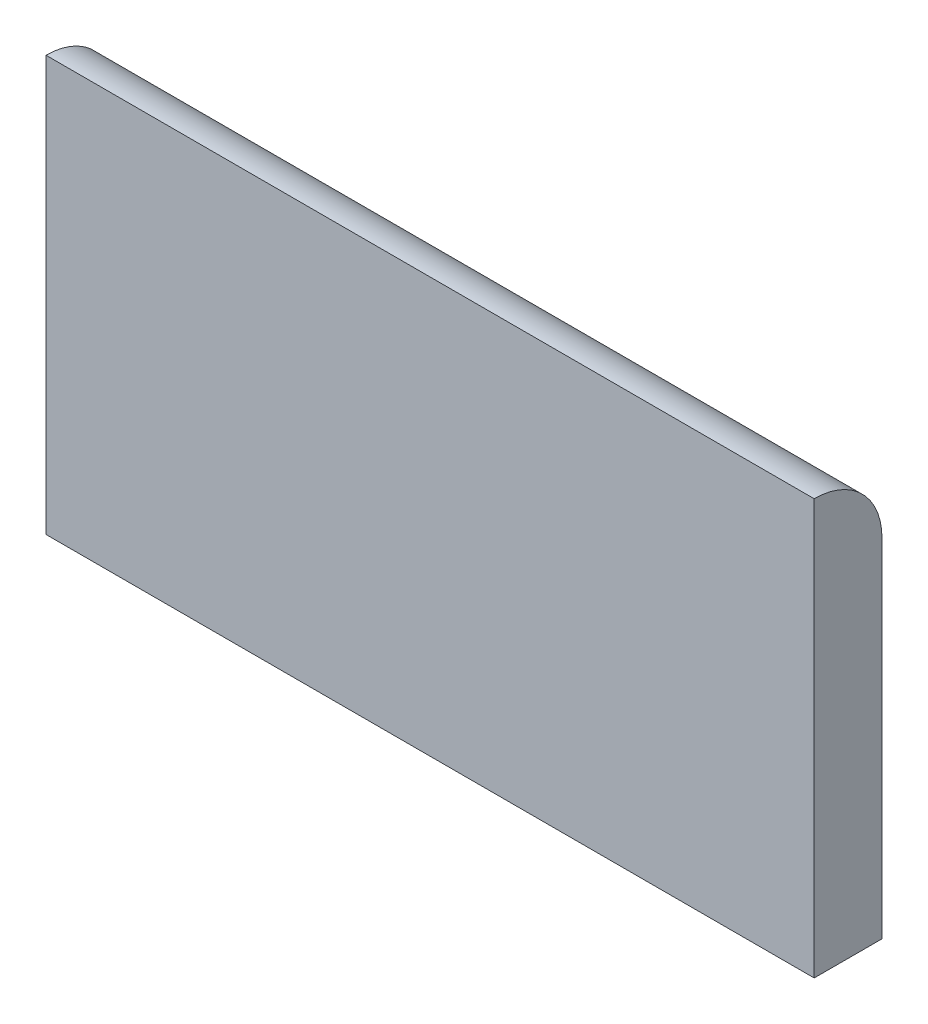
ISO-10303-21;
HEADER;
FILE_DESCRIPTION(('STEP AP214'),'2;1');
FILE_NAME('part.step','',(''),(''),'','','');
FILE_SCHEMA(('AUTOMOTIVE_DESIGN { 1 0 10303 214 1 1 1 1 }'));
ENDSEC;
DATA;
#1=APPLICATION_CONTEXT('core data for automotive mechanical design processes');
#2=APPLICATION_PROTOCOL_DEFINITION('international standard','automotive_design',2000,#1);
#3=PRODUCT_CONTEXT('',#1,'mechanical');
#4=PRODUCT('Part','Part','',(#3));
#5=PRODUCT_RELATED_PRODUCT_CATEGORY('part','',(#4));
#6=PRODUCT_DEFINITION_FORMATION('','',#4);
#7=PRODUCT_DEFINITION_CONTEXT('part definition',#1,'design');
#8=PRODUCT_DEFINITION('design','',#6,#7);
#9=PRODUCT_DEFINITION_SHAPE('','',#8);
#10=(LENGTH_UNIT() NAMED_UNIT(*) SI_UNIT(.MILLI.,.METRE.));
#11=(NAMED_UNIT(*) PLANE_ANGLE_UNIT() SI_UNIT($,.RADIAN.));
#12=(NAMED_UNIT(*) SI_UNIT($,.STERADIAN.) SOLID_ANGLE_UNIT());
#13=UNCERTAINTY_MEASURE_WITH_UNIT(LENGTH_MEASURE(1.E-05),#10,'distance_accuracy_value','');
#14=(GEOMETRIC_REPRESENTATION_CONTEXT(3) GLOBAL_UNCERTAINTY_ASSIGNED_CONTEXT((#13)) GLOBAL_UNIT_ASSIGNED_CONTEXT((#10,
#11,#12)) REPRESENTATION_CONTEXT('',''));
#15=CARTESIAN_POINT('',(0.,0.,0.));
#16=DIRECTION('',(0.,0.,1.));
#17=DIRECTION('',(1.,0.,0.));
#18=AXIS2_PLACEMENT_3D('',#15,#16,#17);
#19=CARTESIAN_POINT('',(-92.5935600232119,54.9638896223897,10.));
#20=DIRECTION('',(1.,0.,0.));
#21=DIRECTION('',(0.,0.,-1.));
#22=AXIS2_PLACEMENT_3D('',#19,#20,#21);
#23=PLANE('',#22);
#24=DIRECTION('',(0.,-1.,0.));
#25=VECTOR('',#24,1.);
#26=CARTESIAN_POINT('',(-92.5935600232119,54.9638896223897,10.));
#27=LINE('',#26,#25);
#28=CARTESIAN_POINT('',(-92.5935600232119,54.9638896223897,10.));
#29=VERTEX_POINT('',#28);
#30=CARTESIAN_POINT('',(-92.5935600232119,-6.25464191295969,10.));
#31=VERTEX_POINT('',#30);
#32=EDGE_CURVE('E96',#29,#31,#27,.T.);
#33=ORIENTED_EDGE('',*,*,#32,.F.);
#34=CARTESIAN_POINT('',(-92.5935600232119,44.9638896223897,10.));
#35=DIRECTION('',(1.,0.,0.));
#36=DIRECTION('',(0.,0.,-1.));
#37=AXIS2_PLACEMENT_3D('',#34,#35,#36);
#38=CIRCLE('',#37,10.);
#39=CARTESIAN_POINT('',(-92.5935600232119,44.9638896223897,0.));
#40=VERTEX_POINT('',#39);
#41=EDGE_CURVE('E66',#29,#40,#38,.F.);
#42=ORIENTED_EDGE('',*,*,#41,.T.);
#43=DIRECTION('',(0.,-1.,0.));
#44=VECTOR('',#43,1.);
#45=CARTESIAN_POINT('',(-92.5935600232119,54.9638896223897,0.));
#46=LINE('',#45,#44);
#47=CARTESIAN_POINT('',(-92.5935600232119,-6.25464191295969,0.));
#48=VERTEX_POINT('',#47);
#49=EDGE_CURVE('E105',#40,#48,#46,.T.);
#50=ORIENTED_EDGE('',*,*,#49,.T.);
#51=DIRECTION('',(0.,0.,-1.));
#52=VECTOR('',#51,1.);
#53=CARTESIAN_POINT('',(-92.5935600232119,-6.25464191295969,10.));
#54=LINE('',#53,#52);
#55=EDGE_CURVE('E88',#31,#48,#54,.T.);
#56=ORIENTED_EDGE('',*,*,#55,.F.);
#57=EDGE_LOOP('',(#33,#42,#50,#56));
#58=FACE_BOUND('',#57,.T.);
#59=ADVANCED_FACE('F43',(#58),#23,.F.);
#60=CARTESIAN_POINT('',(-92.5935600232119,-6.25464191295969,10.));
#61=DIRECTION('',(0.,1.,0.));
#62=DIRECTION('',(0.,0.,1.));
#63=AXIS2_PLACEMENT_3D('',#60,#61,#62);
#64=PLANE('',#63);
#65=DIRECTION('',(1.,0.,0.));
#66=VECTOR('',#65,1.);
#67=CARTESIAN_POINT('',(-92.5935600232119,-6.25464191295969,0.));
#68=LINE('',#67,#66);
#69=CARTESIAN_POINT('',(20.7064087884795,-6.25464191295969,0.));
#70=VERTEX_POINT('',#69);
#71=EDGE_CURVE('E117',#48,#70,#68,.T.);
#72=ORIENTED_EDGE('',*,*,#71,.T.);
#73=DIRECTION('',(0.,0.,-1.));
#74=VECTOR('',#73,1.);
#75=CARTESIAN_POINT('',(20.7064087884795,-6.25464191295969,10.));
#76=LINE('',#75,#74);
#77=CARTESIAN_POINT('',(20.7064087884795,-6.25464191295969,10.));
#78=VERTEX_POINT('',#77);
#79=EDGE_CURVE('E90',#78,#70,#76,.T.);
#80=ORIENTED_EDGE('',*,*,#79,.F.);
#81=DIRECTION('',(1.,0.,0.));
#82=VECTOR('',#81,1.);
#83=CARTESIAN_POINT('',(-92.5935600232119,-6.25464191295969,10.));
#84=LINE('',#83,#82);
#85=EDGE_CURVE('E84',#31,#78,#84,.T.);
#86=ORIENTED_EDGE('',*,*,#85,.F.);
#87=ORIENTED_EDGE('',*,*,#55,.T.);
#88=EDGE_LOOP('',(#72,#80,#86,#87));
#89=FACE_BOUND('',#88,.T.);
#90=ADVANCED_FACE('F86',(#89),#64,.F.);
#91=CARTESIAN_POINT('',(20.7064087884795,54.9638896223897,10.));
#92=DIRECTION('',(-1.,0.,0.));
#93=DIRECTION('',(0.,0.,1.));
#94=AXIS2_PLACEMENT_3D('',#91,#92,#93);
#95=PLANE('',#94);
#96=DIRECTION('',(0.,1.,0.));
#97=VECTOR('',#96,1.);
#98=CARTESIAN_POINT('',(20.7064087884795,54.9638896223897,0.));
#99=LINE('',#98,#97);
#100=CARTESIAN_POINT('',(20.7064087884795,44.9638896223897,0.));
#101=VERTEX_POINT('',#100);
#102=EDGE_CURVE('E103',#70,#101,#99,.T.);
#103=ORIENTED_EDGE('',*,*,#102,.T.);
#104=CARTESIAN_POINT('',(20.7064087884795,44.9638896223897,10.));
#105=DIRECTION('',(-1.,0.,0.));
#106=DIRECTION('',(0.,0.,1.));
#107=AXIS2_PLACEMENT_3D('',#104,#105,#106);
#108=CIRCLE('',#107,10.);
#109=CARTESIAN_POINT('',(20.7064087884795,54.9638896223897,10.));
#110=VERTEX_POINT('',#109);
#111=EDGE_CURVE('E11',#101,#110,#108,.F.);
#112=ORIENTED_EDGE('',*,*,#111,.T.);
#113=DIRECTION('',(0.,1.,0.));
#114=VECTOR('',#113,1.);
#115=CARTESIAN_POINT('',(20.7064087884795,54.9638896223897,10.));
#116=LINE('',#115,#114);
#117=EDGE_CURVE('E95',#78,#110,#116,.T.);
#118=ORIENTED_EDGE('',*,*,#117,.F.);
#119=ORIENTED_EDGE('',*,*,#79,.T.);
#120=EDGE_LOOP('',(#103,#112,#118,#119));
#121=FACE_BOUND('',#120,.T.);
#122=ADVANCED_FACE('F128',(#121),#95,.F.);
#123=CARTESIAN_POINT('',(0.,0.,10.));
#124=DIRECTION('',(0.,0.,1.));
#125=DIRECTION('',(1.,0.,0.));
#126=AXIS2_PLACEMENT_3D('',#123,#124,#125);
#127=PLANE('',#126);
#128=ORIENTED_EDGE('',*,*,#32,.T.);
#129=ORIENTED_EDGE('',*,*,#85,.T.);
#130=ORIENTED_EDGE('',*,*,#117,.T.);
#131=DIRECTION('',(-1.,0.,0.));
#132=VECTOR('',#131,1.);
#133=CARTESIAN_POINT('',(-92.5935600232119,54.9638896223897,10.));
#134=LINE('',#133,#132);
#135=EDGE_CURVE('E101',#110,#29,#134,.T.);
#136=ORIENTED_EDGE('',*,*,#135,.T.);
#137=EDGE_LOOP('',(#128,#129,#130,#136));
#138=FACE_BOUND('',#137,.T.);
#139=ADVANCED_FACE('F99',(#138),#127,.T.);
#140=CARTESIAN_POINT('',(0.,0.,0.));
#141=DIRECTION('',(0.,0.,1.));
#142=DIRECTION('',(1.,0.,0.));
#143=AXIS2_PLACEMENT_3D('',#140,#141,#142);
#144=PLANE('',#143);
#145=ORIENTED_EDGE('',*,*,#49,.F.);
#146=DIRECTION('',(-1.,0.,0.));
#147=VECTOR('',#146,1.);
#148=CARTESIAN_POINT('',(0.,44.9638896223897,0.));
#149=LINE('',#148,#147);
#150=EDGE_CURVE('E52',#40,#101,#149,.F.);
#151=ORIENTED_EDGE('',*,*,#150,.T.);
#152=ORIENTED_EDGE('',*,*,#102,.F.);
#153=ORIENTED_EDGE('',*,*,#71,.F.);
#154=EDGE_LOOP('',(#145,#151,#152,#153));
#155=FACE_BOUND('',#154,.T.);
#156=ADVANCED_FACE('F129',(#155),#144,.F.);
#157=CARTESIAN_POINT('',(-92.5935600232119,44.9638896223897,10.));
#158=DIRECTION('',(-1.,0.,0.));
#159=DIRECTION('',(0.,0.,1.));
#160=AXIS2_PLACEMENT_3D('',#157,#158,#159);
#161=CYLINDRICAL_SURFACE('',#160,10.);
#162=ORIENTED_EDGE('',*,*,#111,.F.);
#163=ORIENTED_EDGE('',*,*,#150,.F.);
#164=ORIENTED_EDGE('',*,*,#41,.F.);
#165=ORIENTED_EDGE('',*,*,#135,.F.);
#166=EDGE_LOOP('',(#162,#163,#164,#165));
#167=FACE_BOUND('',#166,.T.);
#168=ADVANCED_FACE('F45',(#167),#161,.T.);
#169=CLOSED_SHELL('',(#59,#90,#122,#139,#156,#168));
#170=MANIFOLD_SOLID_BREP('B2',#169);
#171=ADVANCED_BREP_SHAPE_REPRESENTATION('',(#18,#170),#14);
#172=SHAPE_DEFINITION_REPRESENTATION(#9,#171);
ENDSEC;
END-ISO-10303-21;
